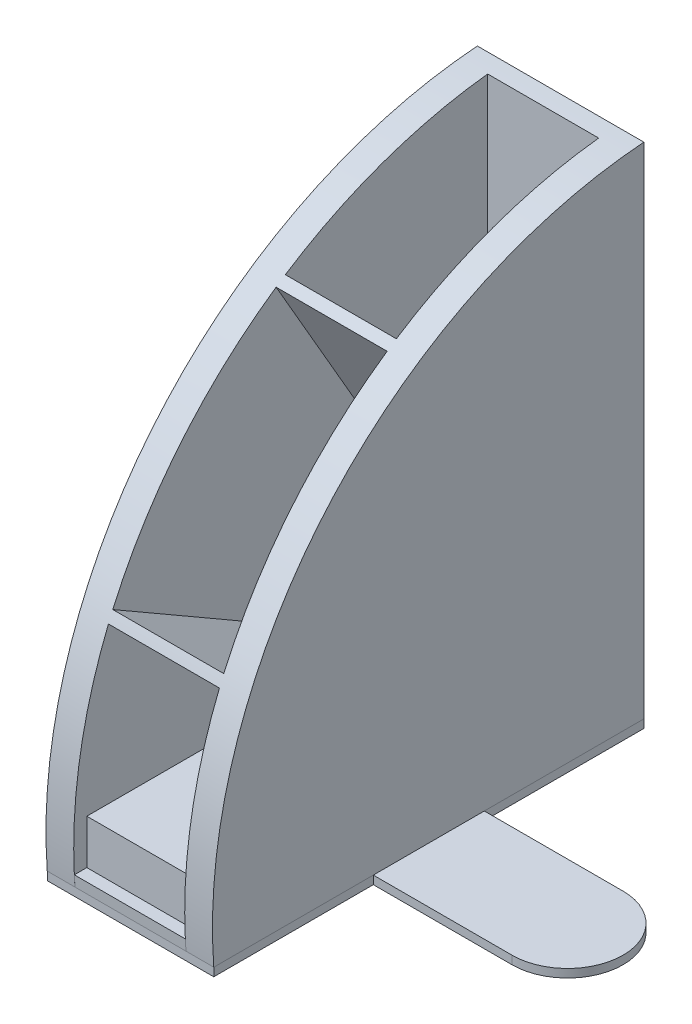
ISO-10303-21;
HEADER;
FILE_DESCRIPTION(('STEP AP214'),'2;1');
FILE_NAME('part.step','',(''),(''),'','','');
FILE_SCHEMA(('AUTOMOTIVE_DESIGN { 1 0 10303 214 1 1 1 1 }'));
ENDSEC;
DATA;
#1=APPLICATION_CONTEXT('core data for automotive mechanical design processes');
#2=APPLICATION_PROTOCOL_DEFINITION('international standard','automotive_design',2000,#1);
#3=PRODUCT_CONTEXT('',#1,'mechanical');
#4=PRODUCT('Part','Part','',(#3));
#5=PRODUCT_RELATED_PRODUCT_CATEGORY('part','',(#4));
#6=PRODUCT_DEFINITION_FORMATION('','',#4);
#7=PRODUCT_DEFINITION_CONTEXT('part definition',#1,'design');
#8=PRODUCT_DEFINITION('design','',#6,#7);
#9=PRODUCT_DEFINITION_SHAPE('','',#8);
#10=(LENGTH_UNIT() NAMED_UNIT(*) SI_UNIT(.MILLI.,.METRE.));
#11=(NAMED_UNIT(*) PLANE_ANGLE_UNIT() SI_UNIT($,.RADIAN.));
#12=(NAMED_UNIT(*) SI_UNIT($,.STERADIAN.) SOLID_ANGLE_UNIT());
#13=UNCERTAINTY_MEASURE_WITH_UNIT(LENGTH_MEASURE(1.E-05),#10,'distance_accuracy_value','');
#14=(GEOMETRIC_REPRESENTATION_CONTEXT(3) GLOBAL_UNCERTAINTY_ASSIGNED_CONTEXT((#13)) GLOBAL_UNIT_ASSIGNED_CONTEXT((#10,
#11,#12)) REPRESENTATION_CONTEXT('',''));
#15=CARTESIAN_POINT('',(0.,0.,0.));
#16=DIRECTION('',(0.,0.,1.));
#17=DIRECTION('',(1.,0.,0.));
#18=AXIS2_PLACEMENT_3D('',#15,#16,#17);
#19=CARTESIAN_POINT('',(110.,-3.00000000000001,77.5));
#20=DIRECTION('',(0.,1.,0.));
#21=DIRECTION('',(0.,0.,1.));
#22=AXIS2_PLACEMENT_3D('',#19,#20,#21);
#23=CYLINDRICAL_SURFACE('',#22,20.);
#24=CARTESIAN_POINT('',(110.,0.,77.5));
#25=DIRECTION('',(0.,-1.,0.));
#26=DIRECTION('',(0.,0.,-1.));
#27=AXIS2_PLACEMENT_3D('',#24,#25,#26);
#28=CIRCLE('',#27,20.);
#29=CARTESIAN_POINT('',(110.,0.,97.5));
#30=VERTEX_POINT('',#29);
#31=CARTESIAN_POINT('',(110.,0.,57.5));
#32=VERTEX_POINT('',#31);
#33=EDGE_CURVE('E209',#30,#32,#28,.F.);
#34=ORIENTED_EDGE('',*,*,#33,.F.);
#35=DIRECTION('',(0.,1.,0.));
#36=VECTOR('',#35,1.);
#37=CARTESIAN_POINT('',(110.,-3.00000000000001,97.5));
#38=LINE('',#37,#36);
#39=CARTESIAN_POINT('',(110.,-3.00000000000001,97.5));
#40=VERTEX_POINT('',#39);
#41=EDGE_CURVE('E13',#40,#30,#38,.T.);
#42=ORIENTED_EDGE('',*,*,#41,.F.);
#43=CARTESIAN_POINT('',(110.,-3.00000000000001,77.5));
#44=DIRECTION('',(0.,-1.,0.));
#45=DIRECTION('',(0.,0.,-1.));
#46=AXIS2_PLACEMENT_3D('',#43,#44,#45);
#47=CIRCLE('',#46,20.);
#48=CARTESIAN_POINT('',(110.,-3.00000000000001,57.5));
#49=VERTEX_POINT('',#48);
#50=EDGE_CURVE('E176',#40,#49,#47,.F.);
#51=ORIENTED_EDGE('',*,*,#50,.T.);
#52=DIRECTION('',(0.,1.,0.));
#53=VECTOR('',#52,1.);
#54=CARTESIAN_POINT('',(110.,-3.00000000000001,57.5));
#55=LINE('',#54,#53);
#56=EDGE_CURVE('E128',#49,#32,#55,.T.);
#57=ORIENTED_EDGE('',*,*,#56,.T.);
#58=EDGE_LOOP('',(#34,#42,#51,#57));
#59=FACE_BOUND('',#58,.T.);
#60=ADVANCED_FACE('F77',(#59),#23,.T.);
#61=CARTESIAN_POINT('',(0.,-3.00000000000001,97.5000000000001));
#62=DIRECTION('',(0.,0.,1.));
#63=DIRECTION('',(1.,0.,0.));
#64=AXIS2_PLACEMENT_3D('',#61,#62,#63);
#65=PLANE('',#64);
#66=DIRECTION('',(1.,0.,0.));
#67=VECTOR('',#66,1.);
#68=CARTESIAN_POINT('',(0.,0.,97.5000000000001));
#69=LINE('',#68,#67);
#70=CARTESIAN_POINT('',(60.,0.,97.5));
#71=VERTEX_POINT('',#70);
#72=EDGE_CURVE('E205',#71,#30,#69,.T.);
#73=ORIENTED_EDGE('',*,*,#72,.F.);
#74=DIRECTION('',(0.,1.,0.));
#75=VECTOR('',#74,1.);
#76=CARTESIAN_POINT('',(60.,-3.00000000000001,97.5));
#77=LINE('',#76,#75);
#78=CARTESIAN_POINT('',(60.,-3.00000000000001,97.5));
#79=VERTEX_POINT('',#78);
#80=EDGE_CURVE('E85',#79,#71,#77,.T.);
#81=ORIENTED_EDGE('',*,*,#80,.F.);
#82=DIRECTION('',(1.,0.,0.));
#83=VECTOR('',#82,1.);
#84=CARTESIAN_POINT('',(0.,-3.00000000000001,97.5000000000001));
#85=LINE('',#84,#83);
#86=EDGE_CURVE('E171',#79,#40,#85,.T.);
#87=ORIENTED_EDGE('',*,*,#86,.T.);
#88=ORIENTED_EDGE('',*,*,#41,.T.);
#89=EDGE_LOOP('',(#73,#81,#87,#88));
#90=FACE_BOUND('',#89,.T.);
#91=ADVANCED_FACE('F208',(#90),#65,.T.);
#92=CARTESIAN_POINT('',(60.,-3.,0.));
#93=DIRECTION('',(-1.,0.,0.));
#94=DIRECTION('',(0.,0.,1.));
#95=AXIS2_PLACEMENT_3D('',#92,#93,#94);
#96=PLANE('',#95);
#97=DIRECTION('',(0.,0.,1.));
#98=VECTOR('',#97,1.);
#99=CARTESIAN_POINT('',(60.,0.,0.));
#100=LINE('',#99,#98);
#101=CARTESIAN_POINT('',(60.,0.,155.));
#102=VERTEX_POINT('',#101);
#103=EDGE_CURVE('E185',#71,#102,#100,.T.);
#104=ORIENTED_EDGE('',*,*,#103,.T.);
#105=DIRECTION('',(0.,1.,0.));
#106=VECTOR('',#105,1.);
#107=CARTESIAN_POINT('',(60.,-3.00000000000002,155.));
#108=LINE('',#107,#106);
#109=CARTESIAN_POINT('',(60.,-3.00000000000002,155.));
#110=VERTEX_POINT('',#109);
#111=EDGE_CURVE('E195',#110,#102,#108,.T.);
#112=ORIENTED_EDGE('',*,*,#111,.F.);
#113=DIRECTION('',(0.,0.,1.));
#114=VECTOR('',#113,1.);
#115=CARTESIAN_POINT('',(60.,-3.,0.));
#116=LINE('',#115,#114);
#117=EDGE_CURVE('E166',#79,#110,#116,.T.);
#118=ORIENTED_EDGE('',*,*,#117,.F.);
#119=ORIENTED_EDGE('',*,*,#80,.T.);
#120=EDGE_LOOP('',(#104,#112,#118,#119));
#121=FACE_BOUND('',#120,.T.);
#122=ADVANCED_FACE('F199',(#121),#96,.F.);
#123=CARTESIAN_POINT('',(0.,-3.00000000000002,155.));
#124=DIRECTION('',(0.,0.,-1.));
#125=DIRECTION('',(0.,1.,0.));
#126=AXIS2_PLACEMENT_3D('',#123,#124,#125);
#127=PLANE('',#126);
#128=DIRECTION('',(-1.,0.,0.));
#129=VECTOR('',#128,1.);
#130=CARTESIAN_POINT('',(0.,0.,155.));
#131=LINE('',#130,#129);
#132=CARTESIAN_POINT('',(0.,0.,155.));
#133=VERTEX_POINT('',#132);
#134=EDGE_CURVE('E207',#102,#133,#131,.T.);
#135=ORIENTED_EDGE('',*,*,#134,.T.);
#136=DIRECTION('',(0.,1.,0.));
#137=VECTOR('',#136,1.);
#138=CARTESIAN_POINT('',(0.,-3.00000000000002,155.));
#139=LINE('',#138,#137);
#140=CARTESIAN_POINT('',(0.,-3.00000000000002,155.));
#141=VERTEX_POINT('',#140);
#142=EDGE_CURVE('E192',#141,#133,#139,.T.);
#143=ORIENTED_EDGE('',*,*,#142,.F.);
#144=DIRECTION('',(-1.,0.,0.));
#145=VECTOR('',#144,1.);
#146=CARTESIAN_POINT('',(0.,-3.00000000000002,155.));
#147=LINE('',#146,#145);
#148=EDGE_CURVE('E170',#110,#141,#147,.T.);
#149=ORIENTED_EDGE('',*,*,#148,.F.);
#150=ORIENTED_EDGE('',*,*,#111,.T.);
#151=EDGE_LOOP('',(#135,#143,#149,#150));
#152=FACE_BOUND('',#151,.T.);
#153=ADVANCED_FACE('F224',(#152),#127,.F.);
#154=CARTESIAN_POINT('',(0.,-3.,0.));
#155=DIRECTION('',(1.,0.,0.));
#156=DIRECTION('',(0.,0.,-1.));
#157=AXIS2_PLACEMENT_3D('',#154,#155,#156);
#158=PLANE('',#157);
#159=DIRECTION('',(0.,0.,-1.));
#160=VECTOR('',#159,1.);
#161=CARTESIAN_POINT('',(0.,0.,0.));
#162=LINE('',#161,#160);
#163=CARTESIAN_POINT('',(0.,0.,0.));
#164=VERTEX_POINT('',#163);
#165=EDGE_CURVE('E213',#133,#164,#162,.T.);
#166=ORIENTED_EDGE('',*,*,#165,.T.);
#167=DIRECTION('',(0.,1.,0.));
#168=VECTOR('',#167,1.);
#169=CARTESIAN_POINT('',(0.,-3.,0.));
#170=LINE('',#169,#168);
#171=CARTESIAN_POINT('',(0.,-3.,0.));
#172=VERTEX_POINT('',#171);
#173=EDGE_CURVE('E161',#172,#164,#170,.T.);
#174=ORIENTED_EDGE('',*,*,#173,.F.);
#175=DIRECTION('',(0.,0.,-1.));
#176=VECTOR('',#175,1.);
#177=CARTESIAN_POINT('',(0.,-3.,0.));
#178=LINE('',#177,#176);
#179=EDGE_CURVE('E152',#141,#172,#178,.T.);
#180=ORIENTED_EDGE('',*,*,#179,.F.);
#181=ORIENTED_EDGE('',*,*,#142,.T.);
#182=EDGE_LOOP('',(#166,#174,#180,#181));
#183=FACE_BOUND('',#182,.T.);
#184=ADVANCED_FACE('F215',(#183),#158,.F.);
#185=CARTESIAN_POINT('',(0.,-3.,0.));
#186=DIRECTION('',(0.,0.,1.));
#187=DIRECTION('',(0.,-1.,0.));
#188=AXIS2_PLACEMENT_3D('',#185,#186,#187);
#189=PLANE('',#188);
#190=DIRECTION('',(1.,0.,0.));
#191=VECTOR('',#190,1.);
#192=CARTESIAN_POINT('',(0.,0.,0.));
#193=LINE('',#192,#191);
#194=CARTESIAN_POINT('',(60.,0.,0.));
#195=VERTEX_POINT('',#194);
#196=EDGE_CURVE('E160',#164,#195,#193,.T.);
#197=ORIENTED_EDGE('',*,*,#196,.T.);
#198=DIRECTION('',(0.,1.,0.));
#199=VECTOR('',#198,1.);
#200=CARTESIAN_POINT('',(60.,-3.,0.));
#201=LINE('',#200,#199);
#202=CARTESIAN_POINT('',(60.,-3.,0.));
#203=VERTEX_POINT('',#202);
#204=EDGE_CURVE('E157',#203,#195,#201,.T.);
#205=ORIENTED_EDGE('',*,*,#204,.F.);
#206=DIRECTION('',(1.,0.,0.));
#207=VECTOR('',#206,1.);
#208=CARTESIAN_POINT('',(0.,-3.,0.));
#209=LINE('',#208,#207);
#210=EDGE_CURVE('E146',#172,#203,#209,.T.);
#211=ORIENTED_EDGE('',*,*,#210,.F.);
#212=ORIENTED_EDGE('',*,*,#173,.T.);
#213=EDGE_LOOP('',(#197,#205,#211,#212));
#214=FACE_BOUND('',#213,.T.);
#215=ADVANCED_FACE('F158',(#214),#189,.F.);
#216=CARTESIAN_POINT('',(60.,0.,57.5));
#217=VERTEX_POINT('',#216);
#218=EDGE_CURVE('E121',#195,#217,#100,.T.);
#219=ORIENTED_EDGE('',*,*,#218,.T.);
#220=DIRECTION('',(0.,1.,0.));
#221=VECTOR('',#220,1.);
#222=CARTESIAN_POINT('',(60.,-3.00000000000001,57.5));
#223=LINE('',#222,#221);
#224=CARTESIAN_POINT('',(60.,-3.00000000000001,57.5));
#225=VERTEX_POINT('',#224);
#226=EDGE_CURVE('E162',#225,#217,#223,.T.);
#227=ORIENTED_EDGE('',*,*,#226,.F.);
#228=EDGE_CURVE('E150',#203,#225,#116,.T.);
#229=ORIENTED_EDGE('',*,*,#228,.F.);
#230=ORIENTED_EDGE('',*,*,#204,.T.);
#231=EDGE_LOOP('',(#219,#227,#229,#230));
#232=FACE_BOUND('',#231,.T.);
#233=ADVANCED_FACE('F164',(#232),#96,.F.);
#234=CARTESIAN_POINT('',(0.,-3.00000000000001,57.5));
#235=DIRECTION('',(0.,0.,1.));
#236=DIRECTION('',(0.,-1.,0.));
#237=AXIS2_PLACEMENT_3D('',#234,#235,#236);
#238=PLANE('',#237);
#239=DIRECTION('',(1.,0.,0.));
#240=VECTOR('',#239,1.);
#241=CARTESIAN_POINT('',(0.,0.,57.5));
#242=LINE('',#241,#240);
#243=EDGE_CURVE('E178',#217,#32,#242,.T.);
#244=ORIENTED_EDGE('',*,*,#243,.T.);
#245=ORIENTED_EDGE('',*,*,#56,.F.);
#246=DIRECTION('',(1.,0.,0.));
#247=VECTOR('',#246,1.);
#248=CARTESIAN_POINT('',(0.,-3.00000000000001,57.5));
#249=LINE('',#248,#247);
#250=EDGE_CURVE('E93',#225,#49,#249,.T.);
#251=ORIENTED_EDGE('',*,*,#250,.F.);
#252=ORIENTED_EDGE('',*,*,#226,.T.);
#253=EDGE_LOOP('',(#244,#245,#251,#252));
#254=FACE_BOUND('',#253,.T.);
#255=ADVANCED_FACE('F235',(#254),#238,.F.);
#256=CARTESIAN_POINT('',(0.,-3.,0.));
#257=DIRECTION('',(0.,-1.,0.));
#258=DIRECTION('',(0.,0.,-1.));
#259=AXIS2_PLACEMENT_3D('',#256,#257,#258);
#260=PLANE('',#259);
#261=ORIENTED_EDGE('',*,*,#50,.F.);
#262=ORIENTED_EDGE('',*,*,#86,.F.);
#263=ORIENTED_EDGE('',*,*,#117,.T.);
#264=ORIENTED_EDGE('',*,*,#148,.T.);
#265=ORIENTED_EDGE('',*,*,#179,.T.);
#266=ORIENTED_EDGE('',*,*,#210,.T.);
#267=ORIENTED_EDGE('',*,*,#228,.T.);
#268=ORIENTED_EDGE('',*,*,#250,.T.);
#269=EDGE_LOOP('',(#261,#262,#263,#264,#265,#266,#267,#268));
#270=FACE_BOUND('',#269,.T.);
#271=ADVANCED_FACE('F148',(#270),#260,.T.);
#272=CARTESIAN_POINT('',(0.,0.,0.));
#273=DIRECTION('',(0.,-1.,0.));
#274=DIRECTION('',(0.,0.,-1.));
#275=AXIS2_PLACEMENT_3D('',#272,#273,#274);
#276=PLANE('',#275);
#277=ORIENTED_EDGE('',*,*,#33,.T.);
#278=ORIENTED_EDGE('',*,*,#243,.F.);
#279=ORIENTED_EDGE('',*,*,#218,.F.);
#280=ORIENTED_EDGE('',*,*,#196,.F.);
#281=ORIENTED_EDGE('',*,*,#165,.F.);
#282=ORIENTED_EDGE('',*,*,#134,.F.);
#283=ORIENTED_EDGE('',*,*,#103,.F.);
#284=ORIENTED_EDGE('',*,*,#72,.T.);
#285=EDGE_LOOP('',(#277,#278,#279,#280,#281,#282,#283,#284));
#286=FACE_BOUND('',#285,.T.);
#287=ADVANCED_FACE('F204',(#286),#276,.F.);
#288=CLOSED_SHELL('',(#60,#91,#122,#153,#184,#215,#233,#255,#271,#287));
#289=MANIFOLD_SOLID_BREP('B2',#288);
#290=CARTESIAN_POINT('',(10.,12.4999999999987,-12.5000000000015));
#291=DIRECTION('',(-1.,0.,0.));
#292=DIRECTION('',(0.,0.,1.));
#293=AXIS2_PLACEMENT_3D('',#290,#291,#292);
#294=PLANE('',#293);
#295=DIRECTION('',(0.,0.,1.));
#296=VECTOR('',#295,1.);
#297=CARTESIAN_POINT('',(10.,20.,150.741836366856));
#298=LINE('',#297,#296);
#299=CARTESIAN_POINT('',(10.,20.,30.1407012212921));
#300=VERTEX_POINT('',#299);
#301=CARTESIAN_POINT('',(10.,20.,37.7820684849984));
#302=VERTEX_POINT('',#301);
#303=EDGE_CURVE('E582',#300,#302,#298,.T.);
#304=ORIENTED_EDGE('',*,*,#303,.F.);
#305=CARTESIAN_POINT('',(10.,3.78865186852187,-3.78865186852191));
#306=DIRECTION('',(1.,0.,0.));
#307=DIRECTION('',(0.,0.,-1.));
#308=AXIS2_PLACEMENT_3D('',#305,#306,#307);
#309=CIRCLE('',#308,37.6033084891908);
#310=CARTESIAN_POINT('',(10.,35.7665623670067,15.9957371663748));
#311=VERTEX_POINT('',#310);
#312=EDGE_CURVE('E705',#300,#311,#309,.F.);
#313=ORIENTED_EDGE('',*,*,#312,.T.);
#314=DIRECTION('',(0.,0.866025403784438,0.500000000000002));
#315=VECTOR('',#314,1.);
#316=CARTESIAN_POINT('',(10.,2.01528322258197,-3.49057293315309));
#317=LINE('',#316,#315);
#318=CARTESIAN_POINT('',(10.,151.000901378918,82.5263138147908));
#319=VERTEX_POINT('',#318);
#320=EDGE_CURVE('E671',#311,#319,#317,.T.);
#321=ORIENTED_EDGE('',*,*,#320,.T.);
#322=CARTESIAN_POINT('',(10.,12.4999999999987,-12.5000000000015));
#323=DIRECTION('',(1.,0.,0.));
#324=DIRECTION('',(0.,0.,1.));
#325=AXIS2_PLACEMENT_3D('',#322,#323,#324);
#326=CIRCLE('',#325,167.96577032241);
#327=CARTESIAN_POINT('',(10.,79.8160389534236,141.386487059849));
#328=VERTEX_POINT('',#327);
#329=EDGE_CURVE('E597',#319,#328,#326,.T.);
#330=ORIENTED_EDGE('',*,*,#329,.T.);
#331=DIRECTION('',(0.,0.499999999999995,0.866025403784442));
#332=VECTOR('',#331,1.);
#333=CARTESIAN_POINT('',(10.,-1.36011555776584,0.785263083405095));
#334=LINE('',#333,#332);
#335=EDGE_CURVE('E668',#302,#328,#334,.T.);
#336=ORIENTED_EDGE('',*,*,#335,.F.);
#337=EDGE_LOOP('',(#304,#313,#321,#330,#336));
#338=FACE_BOUND('',#337,.T.);
#339=ADVANCED_FACE('F361',(#338),#294,.F.);
#340=CARTESIAN_POINT('',(50.,12.4999999999987,-12.5000000000015));
#341=DIRECTION('',(-1.,0.,0.));
#342=DIRECTION('',(0.,0.,1.));
#343=AXIS2_PLACEMENT_3D('',#340,#341,#342);
#344=PLANE('',#343);
#345=CARTESIAN_POINT('',(50.,3.78865186852187,-3.78865186852191));
#346=DIRECTION('',(-1.,0.,0.));
#347=DIRECTION('',(0.,0.,1.));
#348=AXIS2_PLACEMENT_3D('',#345,#346,#347);
#349=CIRCLE('',#348,37.6033084891908);
#350=CARTESIAN_POINT('',(50.,35.7665623670067,15.9957371663748));
#351=VERTEX_POINT('',#350);
#352=CARTESIAN_POINT('',(50.,20.,30.1407012212921));
#353=VERTEX_POINT('',#352);
#354=EDGE_CURVE('E385',#351,#353,#349,.F.);
#355=ORIENTED_EDGE('',*,*,#354,.T.);
#356=DIRECTION('',(0.,0.,1.));
#357=VECTOR('',#356,1.);
#358=CARTESIAN_POINT('',(50.,20.,150.741836366856));
#359=LINE('',#358,#357);
#360=CARTESIAN_POINT('',(50.,20.,37.7820684849984));
#361=VERTEX_POINT('',#360);
#362=EDGE_CURVE('E573',#353,#361,#359,.T.);
#363=ORIENTED_EDGE('',*,*,#362,.T.);
#364=DIRECTION('',(0.,-0.499999999999995,-0.866025403784442));
#365=VECTOR('',#364,1.);
#366=CARTESIAN_POINT('',(50.,-1.36011555776584,0.785263083405095));
#367=LINE('',#366,#365);
#368=CARTESIAN_POINT('',(50.,79.8160389534236,141.386487059849));
#369=VERTEX_POINT('',#368);
#370=EDGE_CURVE('E519',#369,#361,#367,.T.);
#371=ORIENTED_EDGE('',*,*,#370,.F.);
#372=CARTESIAN_POINT('',(50.,12.4999999999987,-12.5000000000015));
#373=DIRECTION('',(-1.,0.,0.));
#374=DIRECTION('',(0.,0.,1.));
#375=AXIS2_PLACEMENT_3D('',#372,#373,#374);
#376=CIRCLE('',#375,167.96577032241);
#377=CARTESIAN_POINT('',(50.,151.000901378918,82.5263138147907));
#378=VERTEX_POINT('',#377);
#379=EDGE_CURVE('E677',#369,#378,#376,.T.);
#380=ORIENTED_EDGE('',*,*,#379,.T.);
#381=DIRECTION('',(0.,-0.866025403784438,-0.500000000000002));
#382=VECTOR('',#381,1.);
#383=CARTESIAN_POINT('',(50.,2.01528322258197,-3.49057293315309));
#384=LINE('',#383,#382);
#385=EDGE_CURVE('E690',#378,#351,#384,.T.);
#386=ORIENTED_EDGE('',*,*,#385,.T.);
#387=EDGE_LOOP('',(#355,#363,#371,#380,#386));
#388=FACE_BOUND('',#387,.T.);
#389=ADVANCED_FACE('F701',(#388),#344,.T.);
#390=DIRECTION('',(0.,-0.866025403784437,-0.500000000000002));
#391=VECTOR('',#390,1.);
#392=CARTESIAN_POINT('',(10.,4.01528322258202,-6.95467454829091));
#393=LINE('',#392,#391);
#394=CARTESIAN_POINT('',(10.,153.229197101775,79.1940187966995));
#395=VERTEX_POINT('',#394);
#396=CARTESIAN_POINT('',(10.,37.6876498257597,12.4860753743056));
#397=VERTEX_POINT('',#396);
#398=EDGE_CURVE('E726',#395,#397,#393,.T.);
#399=ORIENTED_EDGE('',*,*,#398,.T.);
#400=CARTESIAN_POINT('',(10.,40.0175048293035,6.28502782061401));
#401=VERTEX_POINT('',#400);
#402=EDGE_CURVE('E712',#397,#401,#309,.F.);
#403=ORIENTED_EDGE('',*,*,#402,.T.);
#404=DIRECTION('',(0.,1.,0.));
#405=VECTOR('',#404,1.);
#406=CARTESIAN_POINT('',(10.,179.412020926531,6.28502782061401));
#407=LINE('',#406,#405);
#408=CARTESIAN_POINT('',(10.,179.412020926531,6.28502782061401));
#409=VERTEX_POINT('',#408);
#410=EDGE_CURVE('E505',#401,#409,#407,.T.);
#411=ORIENTED_EDGE('',*,*,#410,.T.);
#412=EDGE_CURVE('E593',#409,#395,#326,.T.);
#413=ORIENTED_EDGE('',*,*,#412,.T.);
#414=EDGE_LOOP('',(#399,#403,#411,#413));
#415=FACE_BOUND('',#414,.T.);
#416=ADVANCED_FACE('F767',(#415),#294,.F.);
#417=DIRECTION('',(0.,-0.499999999999995,-0.866025403784442));
#418=VECTOR('',#417,1.);
#419=CARTESIAN_POINT('',(10.,-4.82421717290377,2.78526308340517));
#420=LINE('',#419,#418);
#421=CARTESIAN_POINT('',(10.,76.1042068777315,142.957405315587));
#422=VERTEX_POINT('',#421);
#423=CARTESIAN_POINT('',(10.,20.,45.7820684849989));
#424=VERTEX_POINT('',#423);
#425=EDGE_CURVE('E687',#422,#424,#420,.T.);
#426=ORIENTED_EDGE('',*,*,#425,.F.);
#427=CARTESIAN_POINT('',(10.,3.95640547527622,155.248344232058));
#428=VERTEX_POINT('',#427);
#429=EDGE_CURVE('E654',#422,#428,#326,.T.);
#430=ORIENTED_EDGE('',*,*,#429,.T.);
#431=DIRECTION('',(0.,0.,1.));
#432=VECTOR('',#431,1.);
#433=CARTESIAN_POINT('',(10.,3.95640547527622,155.248344232058));
#434=LINE('',#433,#432);
#435=CARTESIAN_POINT('',(10.,3.95640547527622,150.741836366856));
#436=VERTEX_POINT('',#435);
#437=EDGE_CURVE('E527',#436,#428,#434,.T.);
#438=ORIENTED_EDGE('',*,*,#437,.F.);
#439=DIRECTION('',(0.,-1.,0.));
#440=VECTOR('',#439,1.);
#441=CARTESIAN_POINT('',(10.,20.,150.741836366856));
#442=LINE('',#441,#440);
#443=CARTESIAN_POINT('',(10.,20.,150.741836366856));
#444=VERTEX_POINT('',#443);
#445=EDGE_CURVE('E585',#444,#436,#442,.T.);
#446=ORIENTED_EDGE('',*,*,#445,.F.);
#447=EDGE_CURVE('E572',#424,#444,#298,.T.);
#448=ORIENTED_EDGE('',*,*,#447,.F.);
#449=EDGE_LOOP('',(#426,#430,#438,#446,#448));
#450=FACE_BOUND('',#449,.T.);
#451=ADVANCED_FACE('F652',(#450),#294,.F.);
#452=CARTESIAN_POINT('',(50.,40.0175048293035,6.28502782061401));
#453=VERTEX_POINT('',#452);
#454=CARTESIAN_POINT('',(50.,37.6876498257597,12.4860753743056));
#455=VERTEX_POINT('',#454);
#456=EDGE_CURVE('E486',#453,#455,#349,.F.);
#457=ORIENTED_EDGE('',*,*,#456,.T.);
#458=DIRECTION('',(0.,0.866025403784437,0.500000000000002));
#459=VECTOR('',#458,1.);
#460=CARTESIAN_POINT('',(50.,4.01528322258202,-6.95467454829091));
#461=LINE('',#460,#459);
#462=CARTESIAN_POINT('',(50.,153.229197101775,79.1940187966995));
#463=VERTEX_POINT('',#462);
#464=EDGE_CURVE('E719',#455,#463,#461,.T.);
#465=ORIENTED_EDGE('',*,*,#464,.T.);
#466=CARTESIAN_POINT('',(50.,179.412020926531,6.28502782061401));
#467=VERTEX_POINT('',#466);
#468=EDGE_CURVE('E509',#463,#467,#376,.T.);
#469=ORIENTED_EDGE('',*,*,#468,.T.);
#470=DIRECTION('',(0.,1.,0.));
#471=VECTOR('',#470,1.);
#472=CARTESIAN_POINT('',(50.,179.412020926531,6.28502782061401));
#473=LINE('',#472,#471);
#474=EDGE_CURVE('E503',#453,#467,#473,.T.);
#475=ORIENTED_EDGE('',*,*,#474,.F.);
#476=EDGE_LOOP('',(#457,#465,#469,#475));
#477=FACE_BOUND('',#476,.T.);
#478=ADVANCED_FACE('F508',(#477),#344,.T.);
#479=CARTESIAN_POINT('',(50.,3.95640547527622,155.248344232058));
#480=VERTEX_POINT('',#479);
#481=CARTESIAN_POINT('',(50.,76.1042068777315,142.957405315587));
#482=VERTEX_POINT('',#481);
#483=EDGE_CURVE('E568',#480,#482,#376,.T.);
#484=ORIENTED_EDGE('',*,*,#483,.T.);
#485=DIRECTION('',(0.,0.499999999999995,0.866025403784442));
#486=VECTOR('',#485,1.);
#487=CARTESIAN_POINT('',(50.,-4.82421717290377,2.78526308340517));
#488=LINE('',#487,#486);
#489=CARTESIAN_POINT('',(50.,20.,45.782068484999));
#490=VERTEX_POINT('',#489);
#491=EDGE_CURVE('E513',#490,#482,#488,.T.);
#492=ORIENTED_EDGE('',*,*,#491,.F.);
#493=CARTESIAN_POINT('',(50.,20.,150.741836366856));
#494=VERTEX_POINT('',#493);
#495=EDGE_CURVE('E577',#490,#494,#359,.T.);
#496=ORIENTED_EDGE('',*,*,#495,.T.);
#497=DIRECTION('',(0.,-1.,0.));
#498=VECTOR('',#497,1.);
#499=CARTESIAN_POINT('',(50.,20.,150.741836366856));
#500=LINE('',#499,#498);
#501=CARTESIAN_POINT('',(50.,3.95640547527622,150.741836366856));
#502=VERTEX_POINT('',#501);
#503=EDGE_CURVE('E576',#494,#502,#500,.T.);
#504=ORIENTED_EDGE('',*,*,#503,.T.);
#505=DIRECTION('',(0.,0.,-1.));
#506=VECTOR('',#505,1.);
#507=CARTESIAN_POINT('',(50.,3.95640547527622,155.248344232058));
#508=LINE('',#507,#506);
#509=EDGE_CURVE('E548',#480,#502,#508,.T.);
#510=ORIENTED_EDGE('',*,*,#509,.F.);
#511=EDGE_LOOP('',(#484,#492,#496,#504,#510));
#512=FACE_BOUND('',#511,.T.);
#513=ADVANCED_FACE('F640',(#512),#344,.T.);
#514=CARTESIAN_POINT('',(50.,20.,150.741836366856));
#515=DIRECTION('',(0.,-1.,0.));
#516=DIRECTION('',(0.,0.,-1.));
#517=AXIS2_PLACEMENT_3D('',#514,#515,#516);
#518=PLANE('',#517);
#519=ORIENTED_EDGE('',*,*,#362,.F.);
#520=DIRECTION('',(-1.,0.,0.));
#521=VECTOR('',#520,1.);
#522=CARTESIAN_POINT('',(103.300296563702,20.,30.1407012212921));
#523=LINE('',#522,#521);
#524=EDGE_CURVE('E377',#353,#300,#523,.T.);
#525=ORIENTED_EDGE('',*,*,#524,.T.);
#526=ORIENTED_EDGE('',*,*,#303,.T.);
#527=DIRECTION('',(-1.,0.,0.));
#528=VECTOR('',#527,1.);
#529=CARTESIAN_POINT('',(186.75929789098,20.,37.7820684849984));
#530=LINE('',#529,#528);
#531=EDGE_CURVE('E682',#361,#302,#530,.T.);
#532=ORIENTED_EDGE('',*,*,#531,.F.);
#533=EDGE_LOOP('',(#519,#525,#526,#532));
#534=FACE_BOUND('',#533,.T.);
#535=ADVANCED_FACE('F703',(#534),#518,.F.);
#536=DIRECTION('',(-1.,0.,0.));
#537=VECTOR('',#536,1.);
#538=CARTESIAN_POINT('',(186.75929789098,20.,45.7820684849989));
#539=LINE('',#538,#537);
#540=EDGE_CURVE('E695',#490,#424,#539,.T.);
#541=ORIENTED_EDGE('',*,*,#540,.T.);
#542=ORIENTED_EDGE('',*,*,#447,.T.);
#543=DIRECTION('',(-1.,0.,0.));
#544=VECTOR('',#543,1.);
#545=CARTESIAN_POINT('',(50.,20.,150.741836366856));
#546=LINE('',#545,#544);
#547=EDGE_CURVE('E581',#494,#444,#546,.T.);
#548=ORIENTED_EDGE('',*,*,#547,.F.);
#549=ORIENTED_EDGE('',*,*,#495,.F.);
#550=EDGE_LOOP('',(#541,#542,#548,#549));
#551=FACE_BOUND('',#550,.T.);
#552=ADVANCED_FACE('F753',(#551),#518,.F.);
#553=DIRECTION('',(0.,-0.998035755651074,-0.0626468709672714));
#554=VECTOR('',#553,1.);
#555=CARTESIAN_POINT('',(10.,0.,155.));
#556=LINE('',#555,#554);
#557=CARTESIAN_POINT('',(10.,0.,155.));
#558=VERTEX_POINT('',#557);
#559=EDGE_CURVE('E526',#428,#558,#556,.T.);
#560=ORIENTED_EDGE('',*,*,#559,.F.);
#561=EDGE_CURVE('E598',#428,#558,#326,.T.);
#562=ORIENTED_EDGE('',*,*,#561,.T.);
#563=EDGE_LOOP('',(#560,#562));
#564=FACE_BOUND('',#563,.T.);
#565=ADVANCED_FACE('F658',(#564),#294,.F.);
#566=CARTESIAN_POINT('',(50.,20.,150.741836366856));
#567=DIRECTION('',(0.,0.,-1.));
#568=DIRECTION('',(-1.,0.,0.));
#569=AXIS2_PLACEMENT_3D('',#566,#567,#568);
#570=PLANE('',#569);
#571=DIRECTION('',(-1.,0.,0.));
#572=VECTOR('',#571,1.);
#573=CARTESIAN_POINT('',(60.002,3.95640547527622,150.741836366856));
#574=LINE('',#573,#572);
#575=EDGE_CURVE('E535',#502,#436,#574,.T.);
#576=ORIENTED_EDGE('',*,*,#575,.F.);
#577=ORIENTED_EDGE('',*,*,#503,.F.);
#578=ORIENTED_EDGE('',*,*,#547,.T.);
#579=ORIENTED_EDGE('',*,*,#445,.T.);
#580=EDGE_LOOP('',(#576,#577,#578,#579));
#581=FACE_BOUND('',#580,.T.);
#582=ADVANCED_FACE('F647',(#581),#570,.F.);
#583=CARTESIAN_POINT('',(50.,0.,155.));
#584=VERTEX_POINT('',#583);
#585=EDGE_CURVE('E556',#584,#480,#376,.T.);
#586=ORIENTED_EDGE('',*,*,#585,.T.);
#587=DIRECTION('',(0.,0.998035755651074,0.0626468709672714));
#588=VECTOR('',#587,1.);
#589=CARTESIAN_POINT('',(50.,0.,155.));
#590=LINE('',#589,#588);
#591=EDGE_CURVE('E538',#584,#480,#590,.T.);
#592=ORIENTED_EDGE('',*,*,#591,.F.);
#593=EDGE_LOOP('',(#586,#592));
#594=FACE_BOUND('',#593,.T.);
#595=ADVANCED_FACE('F635',(#594),#344,.T.);
#596=CARTESIAN_POINT('',(10.,0.,0.));
#597=DIRECTION('',(0.,0.,1.));
#598=DIRECTION('',(1.,0.,0.));
#599=AXIS2_PLACEMENT_3D('',#596,#597,#598);
#600=PLANE('',#599);
#601=DIRECTION('',(-1.,0.,0.));
#602=VECTOR('',#601,1.);
#603=CARTESIAN_POINT('',(10.,0.,0.));
#604=LINE('',#603,#602);
#605=CARTESIAN_POINT('',(60.,0.,0.));
#606=VERTEX_POINT('',#605);
#607=CARTESIAN_POINT('',(0.,0.,0.));
#608=VERTEX_POINT('',#607);
#609=EDGE_CURVE('E596',#606,#608,#604,.T.);
#610=ORIENTED_EDGE('',*,*,#609,.T.);
#611=DIRECTION('',(0.,1.,0.));
#612=VECTOR('',#611,1.);
#613=CARTESIAN_POINT('',(0.,0.,0.));
#614=LINE('',#613,#612);
#615=CARTESIAN_POINT('',(0.,180.,0.));
#616=VERTEX_POINT('',#615);
#617=EDGE_CURVE('E592',#608,#616,#614,.T.);
#618=ORIENTED_EDGE('',*,*,#617,.T.);
#619=DIRECTION('',(-1.,0.,0.));
#620=VECTOR('',#619,1.);
#621=CARTESIAN_POINT('',(10.,180.,0.));
#622=LINE('',#621,#620);
#623=CARTESIAN_POINT('',(60.,180.,0.));
#624=VERTEX_POINT('',#623);
#625=EDGE_CURVE('E75',#624,#616,#622,.T.);
#626=ORIENTED_EDGE('',*,*,#625,.F.);
#627=DIRECTION('',(0.,1.,0.));
#628=VECTOR('',#627,1.);
#629=CARTESIAN_POINT('',(60.,0.,0.));
#630=LINE('',#629,#628);
#631=EDGE_CURVE('E555',#606,#624,#630,.T.);
#632=ORIENTED_EDGE('',*,*,#631,.F.);
#633=EDGE_LOOP('',(#610,#618,#626,#632));
#634=FACE_BOUND('',#633,.T.);
#635=ADVANCED_FACE('F363',(#634),#600,.F.);
#636=CARTESIAN_POINT('',(10.,12.4999999999987,-12.5000000000015));
#637=DIRECTION('',(-1.,0.,0.));
#638=DIRECTION('',(0.,0.,1.));
#639=AXIS2_PLACEMENT_3D('',#636,#637,#638);
#640=CYLINDRICAL_SURFACE('',#639,167.96577032241);
#641=ORIENTED_EDGE('',*,*,#329,.F.);
#642=DIRECTION('',(-1.,0.,0.));
#643=VECTOR('',#642,1.);
#644=CARTESIAN_POINT('',(186.75929789098,151.000901378918,82.5263138147908));
#645=LINE('',#644,#643);
#646=EDGE_CURVE('E730',#378,#319,#645,.T.);
#647=ORIENTED_EDGE('',*,*,#646,.F.);
#648=ORIENTED_EDGE('',*,*,#379,.F.);
#649=DIRECTION('',(-1.,0.,0.));
#650=VECTOR('',#649,1.);
#651=CARTESIAN_POINT('',(186.75929789098,79.8160389534236,141.386487059849));
#652=LINE('',#651,#650);
#653=EDGE_CURVE('E676',#369,#328,#652,.T.);
#654=ORIENTED_EDGE('',*,*,#653,.T.);
#655=EDGE_LOOP('',(#641,#647,#648,#654));
#656=FACE_BOUND('',#655,.T.);
#657=ORIENTED_EDGE('',*,*,#429,.F.);
#658=DIRECTION('',(-1.,0.,0.));
#659=VECTOR('',#658,1.);
#660=CARTESIAN_POINT('',(186.75929789098,76.1042068777315,142.957405315587));
#661=LINE('',#660,#659);
#662=EDGE_CURVE('E697',#482,#422,#661,.T.);
#663=ORIENTED_EDGE('',*,*,#662,.F.);
#664=ORIENTED_EDGE('',*,*,#483,.F.);
#665=ORIENTED_EDGE('',*,*,#585,.F.);
#666=DIRECTION('',(-1.,0.,0.));
#667=VECTOR('',#666,1.);
#668=CARTESIAN_POINT('',(60.,0.,155.));
#669=LINE('',#668,#667);
#670=CARTESIAN_POINT('',(60.,0.,155.));
#671=VERTEX_POINT('',#670);
#672=EDGE_CURVE('E564',#671,#584,#669,.T.);
#673=ORIENTED_EDGE('',*,*,#672,.F.);
#674=CARTESIAN_POINT('',(60.,12.4999999999987,-12.5000000000015));
#675=DIRECTION('',(-1.,0.,0.));
#676=DIRECTION('',(0.,0.,1.));
#677=AXIS2_PLACEMENT_3D('',#674,#675,#676);
#678=CIRCLE('',#677,167.96577032241);
#679=EDGE_CURVE('E560',#671,#624,#678,.T.);
#680=ORIENTED_EDGE('',*,*,#679,.T.);
#681=ORIENTED_EDGE('',*,*,#625,.T.);
#682=CARTESIAN_POINT('',(0.,12.4999999999987,-12.5000000000015));
#683=DIRECTION('',(1.,0.,0.));
#684=DIRECTION('',(0.,0.,1.));
#685=AXIS2_PLACEMENT_3D('',#682,#683,#684);
#686=CIRCLE('',#685,167.96577032241);
#687=CARTESIAN_POINT('',(0.,0.,155.));
#688=VERTEX_POINT('',#687);
#689=EDGE_CURVE('E602',#616,#688,#686,.T.);
#690=ORIENTED_EDGE('',*,*,#689,.T.);
#691=DIRECTION('',(-1.,0.,0.));
#692=VECTOR('',#691,1.);
#693=CARTESIAN_POINT('',(10.,0.,155.));
#694=LINE('',#693,#692);
#695=EDGE_CURVE('E370',#558,#688,#694,.T.);
#696=ORIENTED_EDGE('',*,*,#695,.F.);
#697=ORIENTED_EDGE('',*,*,#561,.F.);
#698=EDGE_LOOP('',(#657,#663,#664,#665,#673,#680,#681,#690,#696,#697));
#699=FACE_BOUND('',#698,.T.);
#700=DIRECTION('',(-1.,0.,0.));
#701=VECTOR('',#700,1.);
#702=CARTESIAN_POINT('',(186.75929789098,153.229197101775,79.1940187966995));
#703=LINE('',#702,#701);
#704=EDGE_CURVE('E733',#463,#395,#703,.T.);
#705=ORIENTED_EDGE('',*,*,#704,.T.);
#706=ORIENTED_EDGE('',*,*,#412,.F.);
#707=DIRECTION('',(1.,0.,0.));
#708=VECTOR('',#707,1.);
#709=CARTESIAN_POINT('',(-0.002000000000002,179.412020926531,6.28502782061401));
#710=LINE('',#709,#708);
#711=EDGE_CURVE('E512',#409,#467,#710,.T.);
#712=ORIENTED_EDGE('',*,*,#711,.T.);
#713=ORIENTED_EDGE('',*,*,#468,.F.);
#714=EDGE_LOOP('',(#705,#706,#712,#713));
#715=FACE_BOUND('',#714,.T.);
#716=ADVANCED_FACE('F629',(#656,#699,#715),#640,.T.);
#717=CARTESIAN_POINT('',(10.,0.,0.));
#718=DIRECTION('',(0.,1.,0.));
#719=DIRECTION('',(0.,0.,1.));
#720=AXIS2_PLACEMENT_3D('',#717,#718,#719);
#721=PLANE('',#720);
#722=DIRECTION('',(0.,0.,-1.));
#723=VECTOR('',#722,1.);
#724=CARTESIAN_POINT('',(0.,0.,0.));
#725=LINE('',#724,#723);
#726=EDGE_CURVE('E605',#688,#608,#725,.T.);
#727=ORIENTED_EDGE('',*,*,#726,.T.);
#728=ORIENTED_EDGE('',*,*,#609,.F.);
#729=DIRECTION('',(0.,0.,-1.));
#730=VECTOR('',#729,1.);
#731=CARTESIAN_POINT('',(60.,0.,0.));
#732=LINE('',#731,#730);
#733=EDGE_CURVE('E551',#671,#606,#732,.T.);
#734=ORIENTED_EDGE('',*,*,#733,.F.);
#735=ORIENTED_EDGE('',*,*,#672,.T.);
#736=DIRECTION('',(-1.,0.,0.));
#737=VECTOR('',#736,1.);
#738=CARTESIAN_POINT('',(60.002,0.,155.));
#739=LINE('',#738,#737);
#740=EDGE_CURVE('E531',#584,#558,#739,.T.);
#741=ORIENTED_EDGE('',*,*,#740,.T.);
#742=ORIENTED_EDGE('',*,*,#695,.T.);
#743=EDGE_LOOP('',(#727,#728,#734,#735,#741,#742));
#744=FACE_BOUND('',#743,.T.);
#745=ADVANCED_FACE('F615',(#744),#721,.F.);
#746=CARTESIAN_POINT('',(0.,12.4999999999987,-12.5000000000015));
#747=DIRECTION('',(-1.,0.,0.));
#748=DIRECTION('',(0.,0.,1.));
#749=AXIS2_PLACEMENT_3D('',#746,#747,#748);
#750=PLANE('',#749);
#751=ORIENTED_EDGE('',*,*,#617,.F.);
#752=ORIENTED_EDGE('',*,*,#726,.F.);
#753=ORIENTED_EDGE('',*,*,#689,.F.);
#754=EDGE_LOOP('',(#751,#752,#753));
#755=FACE_BOUND('',#754,.T.);
#756=ADVANCED_FACE('F620',(#755),#750,.T.);
#757=CARTESIAN_POINT('',(60.,12.4999999999987,-12.5000000000015));
#758=DIRECTION('',(-1.,0.,0.));
#759=DIRECTION('',(0.,0.,1.));
#760=AXIS2_PLACEMENT_3D('',#757,#758,#759);
#761=PLANE('',#760);
#762=ORIENTED_EDGE('',*,*,#733,.T.);
#763=ORIENTED_EDGE('',*,*,#631,.T.);
#764=ORIENTED_EDGE('',*,*,#679,.F.);
#765=EDGE_LOOP('',(#762,#763,#764));
#766=FACE_BOUND('',#765,.T.);
#767=ADVANCED_FACE('F627',(#766),#761,.F.);
#768=CARTESIAN_POINT('',(60.002,0.,155.));
#769=DIRECTION('',(0.,0.0626468709672714,-0.998035755651074));
#770=DIRECTION('',(0.,0.998035755651074,0.0626468709672714));
#771=AXIS2_PLACEMENT_3D('',#768,#769,#770);
#772=PLANE('',#771);
#773=ORIENTED_EDGE('',*,*,#740,.F.);
#774=ORIENTED_EDGE('',*,*,#591,.T.);
#775=DIRECTION('',(-1.,0.,0.));
#776=VECTOR('',#775,1.);
#777=CARTESIAN_POINT('',(60.002,3.95640547527622,155.248344232058));
#778=LINE('',#777,#776);
#779=EDGE_CURVE('E539',#480,#428,#778,.T.);
#780=ORIENTED_EDGE('',*,*,#779,.T.);
#781=ORIENTED_EDGE('',*,*,#559,.T.);
#782=EDGE_LOOP('',(#773,#774,#780,#781));
#783=FACE_BOUND('',#782,.T.);
#784=ADVANCED_FACE('F638',(#783),#772,.F.);
#785=CARTESIAN_POINT('',(60.002,3.95640547527622,155.248344232058));
#786=DIRECTION('',(0.,-1.,0.));
#787=DIRECTION('',(0.,0.,-1.));
#788=AXIS2_PLACEMENT_3D('',#785,#786,#787);
#789=PLANE('',#788);
#790=ORIENTED_EDGE('',*,*,#779,.F.);
#791=ORIENTED_EDGE('',*,*,#509,.T.);
#792=ORIENTED_EDGE('',*,*,#575,.T.);
#793=ORIENTED_EDGE('',*,*,#437,.T.);
#794=EDGE_LOOP('',(#790,#791,#792,#793));
#795=FACE_BOUND('',#794,.T.);
#796=ADVANCED_FACE('F644',(#795),#789,.F.);
#797=CARTESIAN_POINT('',(-0.002000000000002,179.412020926531,6.28502782061401));
#798=DIRECTION('',(0.,0.,-1.));
#799=DIRECTION('',(-1.,0.,0.));
#800=AXIS2_PLACEMENT_3D('',#797,#798,#799);
#801=PLANE('',#800);
#802=ORIENTED_EDGE('',*,*,#410,.F.);
#803=DIRECTION('',(-1.,0.,0.));
#804=VECTOR('',#803,1.);
#805=CARTESIAN_POINT('',(103.300296563702,40.0175048293035,6.28502782061401));
#806=LINE('',#805,#804);
#807=EDGE_CURVE('E489',#401,#453,#806,.F.);
#808=ORIENTED_EDGE('',*,*,#807,.T.);
#809=ORIENTED_EDGE('',*,*,#474,.T.);
#810=ORIENTED_EDGE('',*,*,#711,.F.);
#811=EDGE_LOOP('',(#802,#808,#809,#810));
#812=FACE_BOUND('',#811,.T.);
#813=ADVANCED_FACE('F501',(#812),#801,.F.);
#814=CARTESIAN_POINT('',(186.75929789098,-1.36011555776584,0.785263083405095));
#815=DIRECTION('',(0.,-0.866025403784442,0.499999999999995));
#816=DIRECTION('',(0.,-0.499999999999995,-0.866025403784442));
#817=AXIS2_PLACEMENT_3D('',#814,#815,#816);
#818=PLANE('',#817);
#819=ORIENTED_EDGE('',*,*,#653,.F.);
#820=ORIENTED_EDGE('',*,*,#370,.T.);
#821=ORIENTED_EDGE('',*,*,#531,.T.);
#822=ORIENTED_EDGE('',*,*,#335,.T.);
#823=EDGE_LOOP('',(#819,#820,#821,#822));
#824=FACE_BOUND('',#823,.T.);
#825=ADVANCED_FACE('F684',(#824),#818,.F.);
#826=CARTESIAN_POINT('',(186.75929789098,-4.82421717290377,2.78526308340517));
#827=DIRECTION('',(0.,0.866025403784442,-0.499999999999995));
#828=DIRECTION('',(0.,0.499999999999995,0.866025403784442));
#829=AXIS2_PLACEMENT_3D('',#826,#827,#828);
#830=PLANE('',#829);
#831=ORIENTED_EDGE('',*,*,#540,.F.);
#832=ORIENTED_EDGE('',*,*,#491,.T.);
#833=ORIENTED_EDGE('',*,*,#662,.T.);
#834=ORIENTED_EDGE('',*,*,#425,.T.);
#835=EDGE_LOOP('',(#831,#832,#833,#834));
#836=FACE_BOUND('',#835,.T.);
#837=ADVANCED_FACE('F754',(#836),#830,.F.);
#838=CARTESIAN_POINT('',(186.75929789098,4.01528322258202,-6.95467454829091));
#839=DIRECTION('',(0.,0.500000000000002,-0.866025403784437));
#840=DIRECTION('',(0.,0.866025403784437,0.500000000000002));
#841=AXIS2_PLACEMENT_3D('',#838,#839,#840);
#842=PLANE('',#841);
#843=ORIENTED_EDGE('',*,*,#464,.F.);
#844=DIRECTION('',(-1.,0.,0.));
#845=VECTOR('',#844,1.);
#846=CARTESIAN_POINT('',(186.75929789098,37.6876498257597,12.4860753743056));
#847=LINE('',#846,#845);
#848=EDGE_CURVE('E492',#455,#397,#847,.T.);
#849=ORIENTED_EDGE('',*,*,#848,.T.);
#850=ORIENTED_EDGE('',*,*,#398,.F.);
#851=ORIENTED_EDGE('',*,*,#704,.F.);
#852=EDGE_LOOP('',(#843,#849,#850,#851));
#853=FACE_BOUND('',#852,.T.);
#854=ADVANCED_FACE('F742',(#853),#842,.T.);
#855=CARTESIAN_POINT('',(186.75929789098,2.01528322258197,-3.49057293315309));
#856=DIRECTION('',(0.,-0.500000000000002,0.866025403784437));
#857=DIRECTION('',(0.,-0.866025403784438,-0.500000000000002));
#858=AXIS2_PLACEMENT_3D('',#855,#856,#857);
#859=PLANE('',#858);
#860=ORIENTED_EDGE('',*,*,#385,.F.);
#861=ORIENTED_EDGE('',*,*,#646,.T.);
#862=ORIENTED_EDGE('',*,*,#320,.F.);
#863=DIRECTION('',(-1.,0.,0.));
#864=VECTOR('',#863,1.);
#865=CARTESIAN_POINT('',(186.75929789098,35.7665623670067,15.9957371663748));
#866=LINE('',#865,#864);
#867=EDGE_CURVE('E710',#351,#311,#866,.T.);
#868=ORIENTED_EDGE('',*,*,#867,.F.);
#869=EDGE_LOOP('',(#860,#861,#862,#868));
#870=FACE_BOUND('',#869,.T.);
#871=ADVANCED_FACE('F761',(#870),#859,.T.);
#872=CARTESIAN_POINT('',(103.300296563702,3.78865186852187,-3.78865186852191));
#873=DIRECTION('',(-1.,0.,0.));
#874=DIRECTION('',(0.,0.,1.));
#875=AXIS2_PLACEMENT_3D('',#872,#873,#874);
#876=CYLINDRICAL_SURFACE('',#875,37.6033084891908);
#877=ORIENTED_EDGE('',*,*,#524,.F.);
#878=ORIENTED_EDGE('',*,*,#354,.F.);
#879=ORIENTED_EDGE('',*,*,#867,.T.);
#880=ORIENTED_EDGE('',*,*,#312,.F.);
#881=EDGE_LOOP('',(#877,#878,#879,#880));
#882=FACE_BOUND('',#881,.T.);
#883=ADVANCED_FACE('F708',(#882),#876,.T.);
#884=ORIENTED_EDGE('',*,*,#807,.F.);
#885=ORIENTED_EDGE('',*,*,#402,.F.);
#886=ORIENTED_EDGE('',*,*,#848,.F.);
#887=ORIENTED_EDGE('',*,*,#456,.F.);
#888=EDGE_LOOP('',(#884,#885,#886,#887));
#889=FACE_BOUND('',#888,.T.);
#890=ADVANCED_FACE('F488',(#889),#876,.T.);
#891=CLOSED_SHELL('',(#339,#389,#416,#451,#478,#513,#535,#552,#565,#582,#595,#635,#716,#745,
#756,#767,#784,#796,#813,#825,#837,#854,#871,#883,#890));
#892=MANIFOLD_SOLID_BREP('B7',#891);
#893=ADVANCED_BREP_SHAPE_REPRESENTATION('',(#18,#289,#892),#14);
#894=SHAPE_DEFINITION_REPRESENTATION(#9,#893);
ENDSEC;
END-ISO-10303-21;
